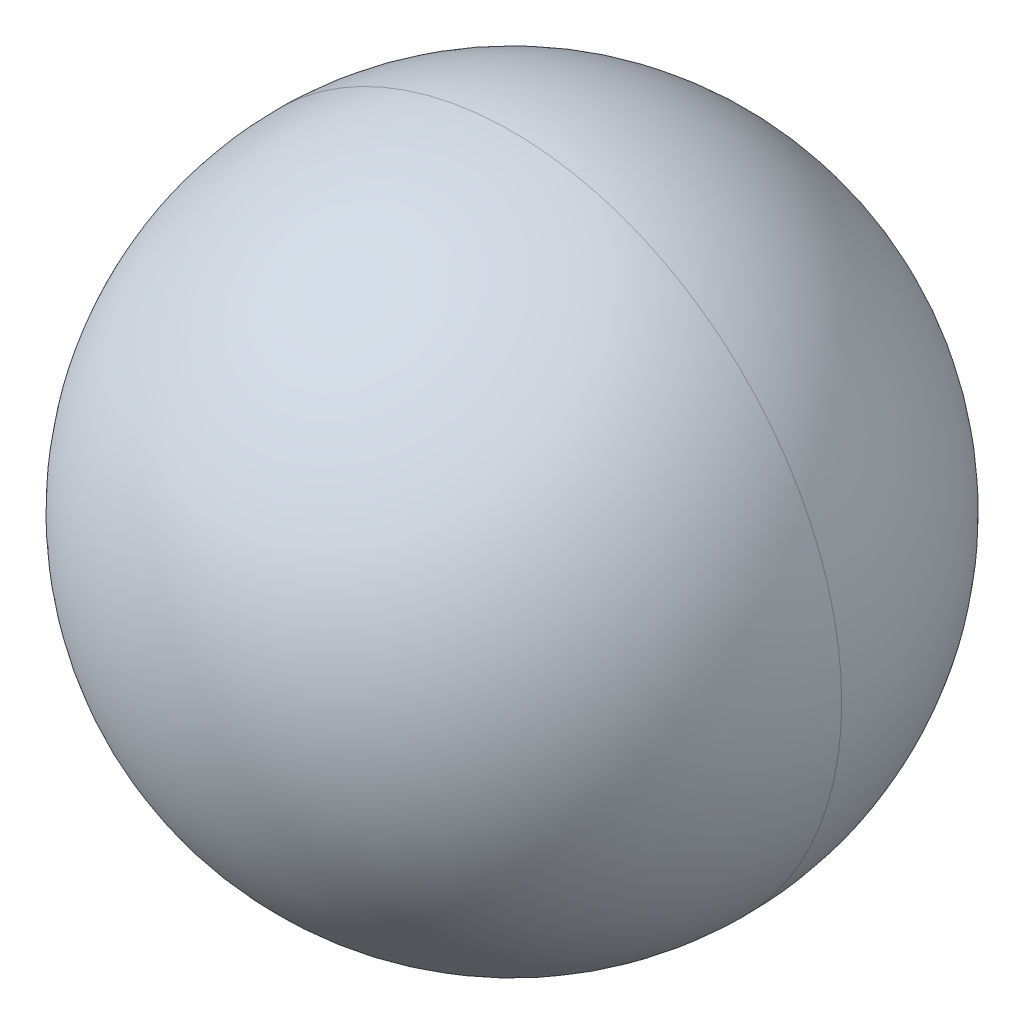
ISO-10303-21;
HEADER;
FILE_DESCRIPTION(('STEP AP214'),'2;1');
FILE_NAME('part.step','',(''),(''),'','','');
FILE_SCHEMA(('AUTOMOTIVE_DESIGN { 1 0 10303 214 1 1 1 1 }'));
ENDSEC;
DATA;
#1=APPLICATION_CONTEXT('core data for automotive mechanical design processes');
#2=APPLICATION_PROTOCOL_DEFINITION('international standard','automotive_design',2000,#1);
#3=PRODUCT_CONTEXT('',#1,'mechanical');
#4=PRODUCT('Part','Part','',(#3));
#5=PRODUCT_RELATED_PRODUCT_CATEGORY('part','',(#4));
#6=PRODUCT_DEFINITION_FORMATION('','',#4);
#7=PRODUCT_DEFINITION_CONTEXT('part definition',#1,'design');
#8=PRODUCT_DEFINITION('design','',#6,#7);
#9=PRODUCT_DEFINITION_SHAPE('','',#8);
#10=(LENGTH_UNIT() NAMED_UNIT(*) SI_UNIT(.MILLI.,.METRE.));
#11=(NAMED_UNIT(*) PLANE_ANGLE_UNIT() SI_UNIT($,.RADIAN.));
#12=(NAMED_UNIT(*) SI_UNIT($,.STERADIAN.) SOLID_ANGLE_UNIT());
#13=UNCERTAINTY_MEASURE_WITH_UNIT(LENGTH_MEASURE(1.E-05),#10,'distance_accuracy_value','');
#14=(GEOMETRIC_REPRESENTATION_CONTEXT(3) GLOBAL_UNCERTAINTY_ASSIGNED_CONTEXT((#13)) GLOBAL_UNIT_ASSIGNED_CONTEXT((#10,
#11,#12)) REPRESENTATION_CONTEXT('',''));
#15=CARTESIAN_POINT('',(0.,0.,0.));
#16=DIRECTION('',(0.,0.,1.));
#17=DIRECTION('',(1.,0.,0.));
#18=AXIS2_PLACEMENT_3D('',#15,#16,#17);
#19=CARTESIAN_POINT('',(8.,62.5,0.));
#20=DIRECTION('',(1.,0.,0.));
#21=DIRECTION('',(0.,0.,1.));
#22=AXIS2_PLACEMENT_3D('',#19,#20,#21);
#23=SPHERICAL_SURFACE('',#22,4.3655);
#24=CARTESIAN_POINT('',(8.,62.5,0.));
#25=DIRECTION('',(0.,0.,-1.));
#26=DIRECTION('',(1.,0.,0.));
#27=AXIS2_PLACEMENT_3D('',#24,#25,#26);
#28=CIRCLE('',#27,4.3655);
#29=CARTESIAN_POINT('',(12.3655,62.5,0.));
#30=VERTEX_POINT('',#29);
#31=CARTESIAN_POINT('',(3.6345,62.5,0.));
#32=VERTEX_POINT('',#31);
#33=EDGE_CURVE('E11',#30,#32,#28,.T.);
#34=ORIENTED_EDGE('',*,*,#33,.T.);
#35=CARTESIAN_POINT('',(8.,62.5,0.));
#36=DIRECTION('',(0.,0.,1.));
#37=DIRECTION('',(1.,0.,0.));
#38=AXIS2_PLACEMENT_3D('',#35,#36,#37);
#39=CIRCLE('',#38,4.3655);
#40=EDGE_CURVE('E25',#30,#32,#39,.T.);
#41=ORIENTED_EDGE('',*,*,#40,.F.);
#42=EDGE_LOOP('',(#34,#41));
#43=FACE_BOUND('',#42,.T.);
#44=ADVANCED_FACE('F17',(#43),#23,.T.);
#45=CARTESIAN_POINT('',(8.,62.5,0.));
#46=DIRECTION('',(1.,0.,0.));
#47=DIRECTION('',(0.,0.,-1.));
#48=AXIS2_PLACEMENT_3D('',#45,#46,#47);
#49=SPHERICAL_SURFACE('',#48,4.3655);
#50=ORIENTED_EDGE('',*,*,#33,.F.);
#51=ORIENTED_EDGE('',*,*,#40,.T.);
#52=EDGE_LOOP('',(#50,#51));
#53=FACE_BOUND('',#52,.T.);
#54=ADVANCED_FACE('F33',(#53),#49,.T.);
#55=CLOSED_SHELL('',(#44,#54));
#56=MANIFOLD_SOLID_BREP('B1',#55);
#57=ADVANCED_BREP_SHAPE_REPRESENTATION('',(#18,#56),#14);
#58=SHAPE_DEFINITION_REPRESENTATION(#9,#57);
ENDSEC;
END-ISO-10303-21;
